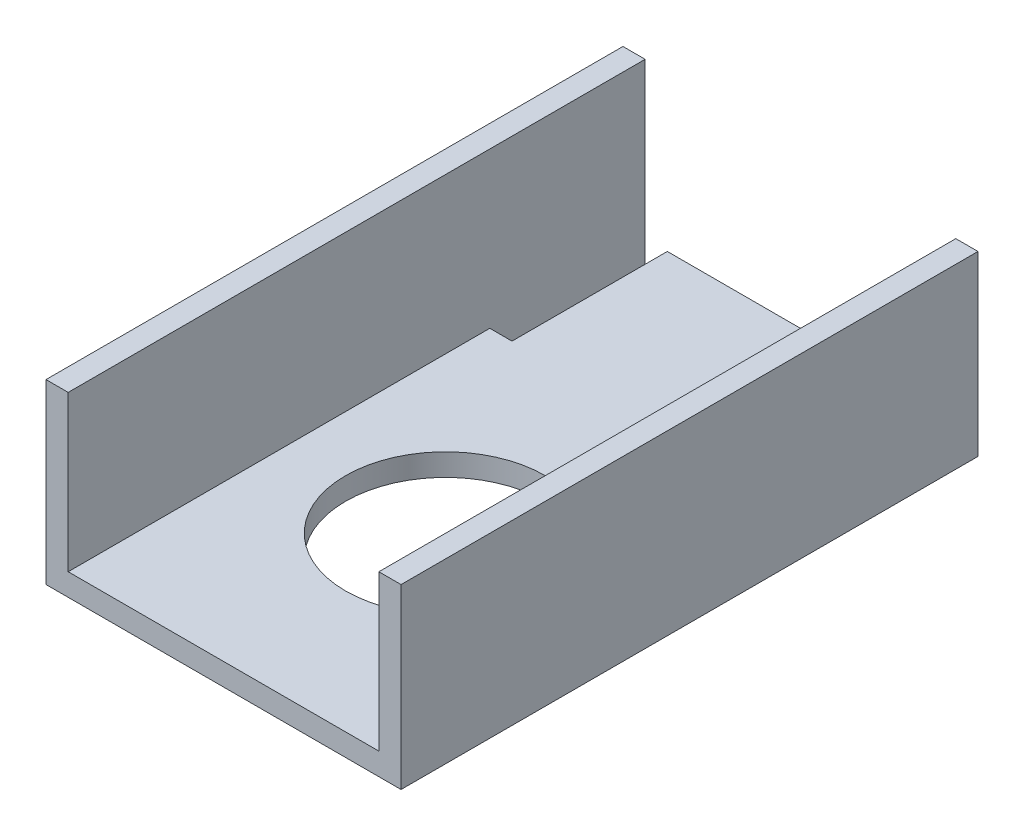
ISO-10303-21;
HEADER;
FILE_DESCRIPTION(('STEP AP214'),'2;1');
FILE_NAME('part.step','',(''),(''),'','','');
FILE_SCHEMA(('AUTOMOTIVE_DESIGN { 1 0 10303 214 1 1 1 1 }'));
ENDSEC;
DATA;
#1=APPLICATION_CONTEXT('core data for automotive mechanical design processes');
#2=APPLICATION_PROTOCOL_DEFINITION('international standard','automotive_design',2000,#1);
#3=PRODUCT_CONTEXT('',#1,'mechanical');
#4=PRODUCT('Part','Part','',(#3));
#5=PRODUCT_RELATED_PRODUCT_CATEGORY('part','',(#4));
#6=PRODUCT_DEFINITION_FORMATION('','',#4);
#7=PRODUCT_DEFINITION_CONTEXT('part definition',#1,'design');
#8=PRODUCT_DEFINITION('design','',#6,#7);
#9=PRODUCT_DEFINITION_SHAPE('','',#8);
#10=(LENGTH_UNIT() NAMED_UNIT(*) SI_UNIT(.MILLI.,.METRE.));
#11=(NAMED_UNIT(*) PLANE_ANGLE_UNIT() SI_UNIT($,.RADIAN.));
#12=(NAMED_UNIT(*) SI_UNIT($,.STERADIAN.) SOLID_ANGLE_UNIT());
#13=UNCERTAINTY_MEASURE_WITH_UNIT(LENGTH_MEASURE(1.E-05),#10,'distance_accuracy_value','');
#14=(GEOMETRIC_REPRESENTATION_CONTEXT(3) GLOBAL_UNCERTAINTY_ASSIGNED_CONTEXT((#13)) GLOBAL_UNIT_ASSIGNED_CONTEXT((#10,
#11,#12)) REPRESENTATION_CONTEXT('',''));
#15=CARTESIAN_POINT('',(0.,0.,0.));
#16=DIRECTION('',(0.,0.,1.));
#17=DIRECTION('',(1.,0.,0.));
#18=AXIS2_PLACEMENT_3D('',#15,#16,#17);
#19=CARTESIAN_POINT('',(0.,0.,0.));
#20=DIRECTION('',(0.,0.,-1.));
#21=DIRECTION('',(-1.,0.,0.));
#22=AXIS2_PLACEMENT_3D('',#19,#20,#21);
#23=PLANE('',#22);
#24=DIRECTION('',(0.,1.,0.));
#25=VECTOR('',#24,1.);
#26=CARTESIAN_POINT('',(3.175,3.175,0.));
#27=LINE('',#26,#25);
#28=CARTESIAN_POINT('',(3.175,0.,0.));
#29=VERTEX_POINT('',#28);
#30=CARTESIAN_POINT('',(3.175,25.4,0.));
#31=VERTEX_POINT('',#30);
#32=EDGE_CURVE('E156',#29,#31,#27,.T.);
#33=ORIENTED_EDGE('',*,*,#32,.F.);
#34=DIRECTION('',(1.,0.,0.));
#35=VECTOR('',#34,1.);
#36=CARTESIAN_POINT('',(0.,0.,0.));
#37=LINE('',#36,#35);
#38=CARTESIAN_POINT('',(0.,0.,0.));
#39=VERTEX_POINT('',#38);
#40=EDGE_CURVE('E145',#39,#29,#37,.T.);
#41=ORIENTED_EDGE('',*,*,#40,.F.);
#42=DIRECTION('',(0.,-1.,0.));
#43=VECTOR('',#42,1.);
#44=CARTESIAN_POINT('',(0.,0.,0.));
#45=LINE('',#44,#43);
#46=CARTESIAN_POINT('',(0.,25.4,0.));
#47=VERTEX_POINT('',#46);
#48=EDGE_CURVE('E140',#47,#39,#45,.T.);
#49=ORIENTED_EDGE('',*,*,#48,.F.);
#50=DIRECTION('',(-1.,0.,0.));
#51=VECTOR('',#50,1.);
#52=CARTESIAN_POINT('',(0.,25.4,0.));
#53=LINE('',#52,#51);
#54=EDGE_CURVE('E86',#31,#47,#53,.T.);
#55=ORIENTED_EDGE('',*,*,#54,.F.);
#56=EDGE_LOOP('',(#33,#41,#49,#55));
#57=FACE_BOUND('',#56,.T.);
#58=ADVANCED_FACE('F32',(#57),#23,.T.);
#59=CARTESIAN_POINT('',(0.,0.,82.55));
#60=DIRECTION('',(1.,0.,0.));
#61=DIRECTION('',(0.,0.,-1.));
#62=AXIS2_PLACEMENT_3D('',#59,#60,#61);
#63=PLANE('',#62);
#64=ORIENTED_EDGE('',*,*,#48,.T.);
#65=DIRECTION('',(0.,0.,-1.));
#66=VECTOR('',#65,1.);
#67=CARTESIAN_POINT('',(0.,0.,82.55));
#68=LINE('',#67,#66);
#69=CARTESIAN_POINT('',(0.,0.,82.55));
#70=VERTEX_POINT('',#69);
#71=EDGE_CURVE('E11',#70,#39,#68,.T.);
#72=ORIENTED_EDGE('',*,*,#71,.F.);
#73=DIRECTION('',(0.,-1.,0.));
#74=VECTOR('',#73,1.);
#75=CARTESIAN_POINT('',(0.,0.,82.55));
#76=LINE('',#75,#74);
#77=CARTESIAN_POINT('',(0.,25.4,82.55));
#78=VERTEX_POINT('',#77);
#79=EDGE_CURVE('E159',#78,#70,#76,.T.);
#80=ORIENTED_EDGE('',*,*,#79,.F.);
#81=DIRECTION('',(0.,0.,-1.));
#82=VECTOR('',#81,1.);
#83=CARTESIAN_POINT('',(0.,25.4,82.55));
#84=LINE('',#83,#82);
#85=EDGE_CURVE('E136',#78,#47,#84,.T.);
#86=ORIENTED_EDGE('',*,*,#85,.T.);
#87=EDGE_LOOP('',(#64,#72,#80,#86));
#88=FACE_BOUND('',#87,.T.);
#89=ADVANCED_FACE('F34',(#88),#63,.F.);
#90=CARTESIAN_POINT('',(0.,0.,82.55));
#91=DIRECTION('',(0.,1.,0.));
#92=DIRECTION('',(0.,0.,1.));
#93=AXIS2_PLACEMENT_3D('',#90,#91,#92);
#94=PLANE('',#93);
#95=ORIENTED_EDGE('',*,*,#40,.T.);
#96=DIRECTION('',(0.,0.,-1.));
#97=VECTOR('',#96,1.);
#98=CARTESIAN_POINT('',(3.175,0.,22.225));
#99=LINE('',#98,#97);
#100=CARTESIAN_POINT('',(3.175,0.,22.225));
#101=VERTEX_POINT('',#100);
#102=EDGE_CURVE('E211',#101,#29,#99,.T.);
#103=ORIENTED_EDGE('',*,*,#102,.F.);
#104=DIRECTION('',(-1.,0.,0.));
#105=VECTOR('',#104,1.);
#106=CARTESIAN_POINT('',(3.175,0.,22.225));
#107=LINE('',#106,#105);
#108=CARTESIAN_POINT('',(6.35,0.,22.225));
#109=VERTEX_POINT('',#108);
#110=EDGE_CURVE('E199',#109,#101,#107,.T.);
#111=ORIENTED_EDGE('',*,*,#110,.F.);
#112=DIRECTION('',(0.,0.,1.));
#113=VECTOR('',#112,1.);
#114=CARTESIAN_POINT('',(6.35,0.,22.225));
#115=LINE('',#114,#113);
#116=CARTESIAN_POINT('',(6.35,0.,0.));
#117=VERTEX_POINT('',#116);
#118=EDGE_CURVE('E214',#117,#109,#115,.T.);
#119=ORIENTED_EDGE('',*,*,#118,.F.);
#120=CARTESIAN_POINT('',(50.8,0.,0.));
#121=VERTEX_POINT('',#120);
#122=EDGE_CURVE('E143',#117,#121,#37,.T.);
#123=ORIENTED_EDGE('',*,*,#122,.T.);
#124=DIRECTION('',(0.,0.,-1.));
#125=VECTOR('',#124,1.);
#126=CARTESIAN_POINT('',(50.8,0.,82.55));
#127=LINE('',#126,#125);
#128=CARTESIAN_POINT('',(50.8,0.,82.55));
#129=VERTEX_POINT('',#128);
#130=EDGE_CURVE('E40',#129,#121,#127,.T.);
#131=ORIENTED_EDGE('',*,*,#130,.F.);
#132=DIRECTION('',(1.,0.,0.));
#133=VECTOR('',#132,1.);
#134=CARTESIAN_POINT('',(0.,0.,82.55));
#135=LINE('',#134,#133);
#136=EDGE_CURVE('E94',#70,#129,#135,.T.);
#137=ORIENTED_EDGE('',*,*,#136,.F.);
#138=ORIENTED_EDGE('',*,*,#71,.T.);
#139=EDGE_LOOP('',(#95,#103,#111,#119,#123,#131,#137,#138));
#140=FACE_BOUND('',#139,.T.);
#141=CARTESIAN_POINT('',(25.4,0.,50.8));
#142=DIRECTION('',(0.,-1.,0.));
#143=DIRECTION('',(0.,0.,-1.));
#144=AXIS2_PLACEMENT_3D('',#141,#142,#143);
#145=CIRCLE('',#144,14.2875);
#146=CARTESIAN_POINT('',(25.4,0.,36.5125));
#147=VERTEX_POINT('',#146);
#148=EDGE_CURVE('E196',#147,#147,#145,.T.);
#149=ORIENTED_EDGE('',*,*,#148,.F.);
#150=EDGE_LOOP('',(#149));
#151=FACE_BOUND('',#150,.T.);
#152=ADVANCED_FACE('F224',(#140,#151),#94,.F.);
#153=CARTESIAN_POINT('',(50.8,0.,82.55));
#154=DIRECTION('',(-1.,0.,0.));
#155=DIRECTION('',(0.,0.,1.));
#156=AXIS2_PLACEMENT_3D('',#153,#154,#155);
#157=PLANE('',#156);
#158=DIRECTION('',(0.,1.,0.));
#159=VECTOR('',#158,1.);
#160=CARTESIAN_POINT('',(50.8,0.,0.));
#161=LINE('',#160,#159);
#162=CARTESIAN_POINT('',(50.8,25.4,0.));
#163=VERTEX_POINT('',#162);
#164=EDGE_CURVE('E148',#121,#163,#161,.T.);
#165=ORIENTED_EDGE('',*,*,#164,.T.);
#166=DIRECTION('',(0.,0.,-1.));
#167=VECTOR('',#166,1.);
#168=CARTESIAN_POINT('',(50.8,25.4,82.55));
#169=LINE('',#168,#167);
#170=CARTESIAN_POINT('',(50.8,25.4,82.55));
#171=VERTEX_POINT('',#170);
#172=EDGE_CURVE('E166',#171,#163,#169,.T.);
#173=ORIENTED_EDGE('',*,*,#172,.F.);
#174=DIRECTION('',(0.,1.,0.));
#175=VECTOR('',#174,1.);
#176=CARTESIAN_POINT('',(50.8,0.,82.55));
#177=LINE('',#176,#175);
#178=EDGE_CURVE('E174',#129,#171,#177,.T.);
#179=ORIENTED_EDGE('',*,*,#178,.F.);
#180=ORIENTED_EDGE('',*,*,#130,.T.);
#181=EDGE_LOOP('',(#165,#173,#179,#180));
#182=FACE_BOUND('',#181,.T.);
#183=ADVANCED_FACE('F172',(#182),#157,.F.);
#184=CARTESIAN_POINT('',(50.8,25.4,82.55));
#185=DIRECTION('',(0.,-1.,0.));
#186=DIRECTION('',(0.,0.,-1.));
#187=AXIS2_PLACEMENT_3D('',#184,#185,#186);
#188=PLANE('',#187);
#189=DIRECTION('',(-1.,0.,0.));
#190=VECTOR('',#189,1.);
#191=CARTESIAN_POINT('',(50.8,25.4,0.));
#192=LINE('',#191,#190);
#193=CARTESIAN_POINT('',(47.625,25.4,0.));
#194=VERTEX_POINT('',#193);
#195=EDGE_CURVE('E150',#163,#194,#192,.T.);
#196=ORIENTED_EDGE('',*,*,#195,.T.);
#197=DIRECTION('',(0.,0.,-1.));
#198=VECTOR('',#197,1.);
#199=CARTESIAN_POINT('',(47.625,25.4,82.55));
#200=LINE('',#199,#198);
#201=CARTESIAN_POINT('',(47.625,25.4,82.55));
#202=VERTEX_POINT('',#201);
#203=EDGE_CURVE('E163',#202,#194,#200,.T.);
#204=ORIENTED_EDGE('',*,*,#203,.F.);
#205=DIRECTION('',(-1.,0.,0.));
#206=VECTOR('',#205,1.);
#207=CARTESIAN_POINT('',(50.8,25.4,82.55));
#208=LINE('',#207,#206);
#209=EDGE_CURVE('E188',#171,#202,#208,.T.);
#210=ORIENTED_EDGE('',*,*,#209,.F.);
#211=ORIENTED_EDGE('',*,*,#172,.T.);
#212=EDGE_LOOP('',(#196,#204,#210,#211));
#213=FACE_BOUND('',#212,.T.);
#214=ADVANCED_FACE('F184',(#213),#188,.F.);
#215=CARTESIAN_POINT('',(47.625,3.175,82.55));
#216=DIRECTION('',(1.,0.,0.));
#217=DIRECTION('',(0.,0.,-1.));
#218=AXIS2_PLACEMENT_3D('',#215,#216,#217);
#219=PLANE('',#218);
#220=DIRECTION('',(0.,-1.,0.));
#221=VECTOR('',#220,1.);
#222=CARTESIAN_POINT('',(47.625,3.175,0.));
#223=LINE('',#222,#221);
#224=CARTESIAN_POINT('',(47.625,3.175,0.));
#225=VERTEX_POINT('',#224);
#226=EDGE_CURVE('E152',#194,#225,#223,.T.);
#227=ORIENTED_EDGE('',*,*,#226,.T.);
#228=DIRECTION('',(0.,0.,-1.));
#229=VECTOR('',#228,1.);
#230=CARTESIAN_POINT('',(47.625,3.175,82.55));
#231=LINE('',#230,#229);
#232=CARTESIAN_POINT('',(47.625,3.175,82.55));
#233=VERTEX_POINT('',#232);
#234=EDGE_CURVE('E131',#233,#225,#231,.T.);
#235=ORIENTED_EDGE('',*,*,#234,.F.);
#236=DIRECTION('',(0.,-1.,0.));
#237=VECTOR('',#236,1.);
#238=CARTESIAN_POINT('',(47.625,3.175,82.55));
#239=LINE('',#238,#237);
#240=EDGE_CURVE('E116',#202,#233,#239,.T.);
#241=ORIENTED_EDGE('',*,*,#240,.F.);
#242=ORIENTED_EDGE('',*,*,#203,.T.);
#243=EDGE_LOOP('',(#227,#235,#241,#242));
#244=FACE_BOUND('',#243,.T.);
#245=ADVANCED_FACE('F187',(#244),#219,.F.);
#246=CARTESIAN_POINT('',(3.175,3.175,82.55));
#247=DIRECTION('',(0.,-1.,0.));
#248=DIRECTION('',(0.,0.,-1.));
#249=AXIS2_PLACEMENT_3D('',#246,#247,#248);
#250=PLANE('',#249);
#251=CARTESIAN_POINT('',(25.4,3.175,50.8));
#252=DIRECTION('',(0.,-1.,0.));
#253=DIRECTION('',(0.,0.,-1.));
#254=AXIS2_PLACEMENT_3D('',#251,#252,#253);
#255=CIRCLE('',#254,14.2875);
#256=CARTESIAN_POINT('',(25.4,3.175,36.5125));
#257=VERTEX_POINT('',#256);
#258=EDGE_CURVE('E144',#257,#257,#255,.F.);
#259=ORIENTED_EDGE('',*,*,#258,.F.);
#260=EDGE_LOOP('',(#259));
#261=FACE_BOUND('',#260,.T.);
#262=DIRECTION('',(-1.,0.,0.));
#263=VECTOR('',#262,1.);
#264=CARTESIAN_POINT('',(3.175,3.175,0.));
#265=LINE('',#264,#263);
#266=CARTESIAN_POINT('',(6.35,3.175,0.));
#267=VERTEX_POINT('',#266);
#268=EDGE_CURVE('E154',#225,#267,#265,.T.);
#269=ORIENTED_EDGE('',*,*,#268,.T.);
#270=DIRECTION('',(0.,0.,-1.));
#271=VECTOR('',#270,1.);
#272=CARTESIAN_POINT('',(6.35,3.175,22.225));
#273=LINE('',#272,#271);
#274=CARTESIAN_POINT('',(6.35,3.175,22.225));
#275=VERTEX_POINT('',#274);
#276=EDGE_CURVE('E47',#275,#267,#273,.T.);
#277=ORIENTED_EDGE('',*,*,#276,.F.);
#278=DIRECTION('',(1.,0.,0.));
#279=VECTOR('',#278,1.);
#280=CARTESIAN_POINT('',(3.175,3.175,22.225));
#281=LINE('',#280,#279);
#282=CARTESIAN_POINT('',(3.175,3.175,22.225));
#283=VERTEX_POINT('',#282);
#284=EDGE_CURVE('E128',#283,#275,#281,.T.);
#285=ORIENTED_EDGE('',*,*,#284,.F.);
#286=DIRECTION('',(0.,0.,-1.));
#287=VECTOR('',#286,1.);
#288=CARTESIAN_POINT('',(3.175,3.175,82.55));
#289=LINE('',#288,#287);
#290=CARTESIAN_POINT('',(3.175,3.175,82.55));
#291=VERTEX_POINT('',#290);
#292=EDGE_CURVE('E123',#291,#283,#289,.T.);
#293=ORIENTED_EDGE('',*,*,#292,.F.);
#294=DIRECTION('',(-1.,0.,0.));
#295=VECTOR('',#294,1.);
#296=CARTESIAN_POINT('',(3.175,3.175,82.55));
#297=LINE('',#296,#295);
#298=EDGE_CURVE('E109',#233,#291,#297,.T.);
#299=ORIENTED_EDGE('',*,*,#298,.F.);
#300=ORIENTED_EDGE('',*,*,#234,.T.);
#301=EDGE_LOOP('',(#269,#277,#285,#293,#299,#300));
#302=FACE_BOUND('',#301,.T.);
#303=ADVANCED_FACE('F125',(#261,#302),#250,.F.);
#304=CARTESIAN_POINT('',(3.175,3.175,82.55));
#305=DIRECTION('',(-1.,0.,0.));
#306=DIRECTION('',(0.,0.,1.));
#307=AXIS2_PLACEMENT_3D('',#304,#305,#306);
#308=PLANE('',#307);
#309=ORIENTED_EDGE('',*,*,#32,.T.);
#310=DIRECTION('',(0.,0.,-1.));
#311=VECTOR('',#310,1.);
#312=CARTESIAN_POINT('',(3.175,25.4,82.55));
#313=LINE('',#312,#311);
#314=CARTESIAN_POINT('',(3.175,25.4,82.55));
#315=VERTEX_POINT('',#314);
#316=EDGE_CURVE('E132',#315,#31,#313,.T.);
#317=ORIENTED_EDGE('',*,*,#316,.F.);
#318=DIRECTION('',(0.,1.,0.));
#319=VECTOR('',#318,1.);
#320=CARTESIAN_POINT('',(3.175,3.175,82.55));
#321=LINE('',#320,#319);
#322=EDGE_CURVE('E113',#291,#315,#321,.T.);
#323=ORIENTED_EDGE('',*,*,#322,.F.);
#324=ORIENTED_EDGE('',*,*,#292,.T.);
#325=DIRECTION('',(0.,1.,0.));
#326=VECTOR('',#325,1.);
#327=CARTESIAN_POINT('',(3.175,-0.00100000000000013,22.225));
#328=LINE('',#327,#326);
#329=EDGE_CURVE('E203',#101,#283,#328,.T.);
#330=ORIENTED_EDGE('',*,*,#329,.F.);
#331=ORIENTED_EDGE('',*,*,#102,.T.);
#332=EDGE_LOOP('',(#309,#317,#323,#324,#330,#331));
#333=FACE_BOUND('',#332,.T.);
#334=ADVANCED_FACE('F134',(#333),#308,.F.);
#335=CARTESIAN_POINT('',(0.,25.4,82.55));
#336=DIRECTION('',(0.,-1.,0.));
#337=DIRECTION('',(0.,0.,-1.));
#338=AXIS2_PLACEMENT_3D('',#335,#336,#337);
#339=PLANE('',#338);
#340=ORIENTED_EDGE('',*,*,#54,.T.);
#341=ORIENTED_EDGE('',*,*,#85,.F.);
#342=DIRECTION('',(-1.,0.,0.));
#343=VECTOR('',#342,1.);
#344=CARTESIAN_POINT('',(0.,25.4,82.55));
#345=LINE('',#344,#343);
#346=EDGE_CURVE('E56',#315,#78,#345,.T.);
#347=ORIENTED_EDGE('',*,*,#346,.F.);
#348=ORIENTED_EDGE('',*,*,#316,.T.);
#349=EDGE_LOOP('',(#340,#341,#347,#348));
#350=FACE_BOUND('',#349,.T.);
#351=ADVANCED_FACE('F238',(#350),#339,.F.);
#352=CARTESIAN_POINT('',(0.,0.,82.55));
#353=DIRECTION('',(0.,0.,-1.));
#354=DIRECTION('',(-1.,0.,0.));
#355=AXIS2_PLACEMENT_3D('',#352,#353,#354);
#356=PLANE('',#355);
#357=ORIENTED_EDGE('',*,*,#79,.T.);
#358=ORIENTED_EDGE('',*,*,#136,.T.);
#359=ORIENTED_EDGE('',*,*,#178,.T.);
#360=ORIENTED_EDGE('',*,*,#209,.T.);
#361=ORIENTED_EDGE('',*,*,#240,.T.);
#362=ORIENTED_EDGE('',*,*,#298,.T.);
#363=ORIENTED_EDGE('',*,*,#322,.T.);
#364=ORIENTED_EDGE('',*,*,#346,.T.);
#365=EDGE_LOOP('',(#357,#358,#359,#360,#361,#362,#363,#364));
#366=FACE_BOUND('',#365,.T.);
#367=ADVANCED_FACE('F111',(#366),#356,.F.);
#368=DIRECTION('',(0.,1.,0.));
#369=VECTOR('',#368,1.);
#370=CARTESIAN_POINT('',(6.35,-0.00100000000000013,0.));
#371=LINE('',#370,#369);
#372=EDGE_CURVE('E202',#117,#267,#371,.T.);
#373=ORIENTED_EDGE('',*,*,#372,.T.);
#374=ORIENTED_EDGE('',*,*,#268,.F.);
#375=ORIENTED_EDGE('',*,*,#226,.F.);
#376=ORIENTED_EDGE('',*,*,#195,.F.);
#377=ORIENTED_EDGE('',*,*,#164,.F.);
#378=ORIENTED_EDGE('',*,*,#122,.F.);
#379=EDGE_LOOP('',(#373,#374,#375,#376,#377,#378));
#380=FACE_BOUND('',#379,.T.);
#381=ADVANCED_FACE('F178',(#380),#23,.T.);
#382=CARTESIAN_POINT('',(25.4,25.401,50.8));
#383=DIRECTION('',(0.,-1.,0.));
#384=DIRECTION('',(0.,0.,-1.));
#385=AXIS2_PLACEMENT_3D('',#382,#383,#384);
#386=CYLINDRICAL_SURFACE('',#385,14.2875);
#387=ORIENTED_EDGE('',*,*,#148,.T.);
#388=EDGE_LOOP('',(#387));
#389=FACE_BOUND('',#388,.T.);
#390=ORIENTED_EDGE('',*,*,#258,.T.);
#391=EDGE_LOOP('',(#390));
#392=FACE_BOUND('',#391,.T.);
#393=ADVANCED_FACE('F253',(#389,#392),#386,.F.);
#394=CARTESIAN_POINT('',(6.35,-0.00100000000000013,22.225));
#395=DIRECTION('',(1.,0.,0.));
#396=DIRECTION('',(0.,0.,-1.));
#397=AXIS2_PLACEMENT_3D('',#394,#395,#396);
#398=PLANE('',#397);
#399=ORIENTED_EDGE('',*,*,#118,.T.);
#400=DIRECTION('',(0.,1.,0.));
#401=VECTOR('',#400,1.);
#402=CARTESIAN_POINT('',(6.35,-0.00100000000000013,22.225));
#403=LINE('',#402,#401);
#404=EDGE_CURVE('E206',#109,#275,#403,.T.);
#405=ORIENTED_EDGE('',*,*,#404,.T.);
#406=ORIENTED_EDGE('',*,*,#276,.T.);
#407=ORIENTED_EDGE('',*,*,#372,.F.);
#408=EDGE_LOOP('',(#399,#405,#406,#407));
#409=FACE_BOUND('',#408,.T.);
#410=ADVANCED_FACE('F219',(#409),#398,.F.);
#411=CARTESIAN_POINT('',(3.175,-0.00100000000000013,22.225));
#412=DIRECTION('',(0.,0.,1.));
#413=DIRECTION('',(1.,0.,0.));
#414=AXIS2_PLACEMENT_3D('',#411,#412,#413);
#415=PLANE('',#414);
#416=ORIENTED_EDGE('',*,*,#110,.T.);
#417=ORIENTED_EDGE('',*,*,#329,.T.);
#418=ORIENTED_EDGE('',*,*,#284,.T.);
#419=ORIENTED_EDGE('',*,*,#404,.F.);
#420=EDGE_LOOP('',(#416,#417,#418,#419));
#421=FACE_BOUND('',#420,.T.);
#422=ADVANCED_FACE('F228',(#421),#415,.F.);
#423=CLOSED_SHELL('',(#58,#89,#152,#183,#214,#245,#303,#334,#351,#367,#381,#393,#410,#422));
#424=MANIFOLD_SOLID_BREP('B2',#423);
#425=ADVANCED_BREP_SHAPE_REPRESENTATION('',(#18,#424),#14);
#426=SHAPE_DEFINITION_REPRESENTATION(#9,#425);
ENDSEC;
END-ISO-10303-21;
